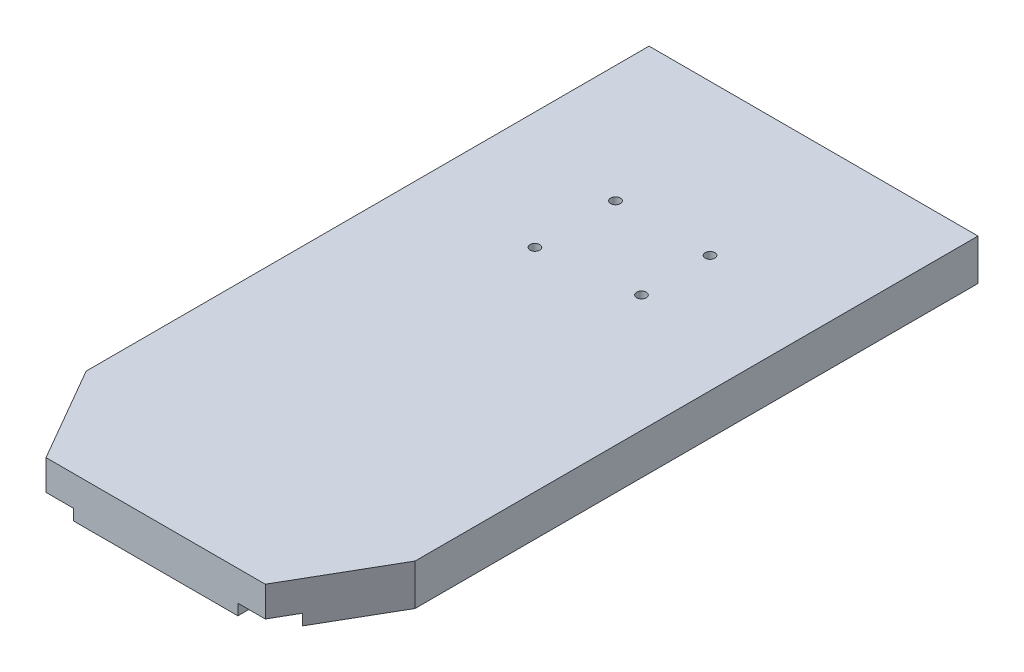
ISO-10303-21;
HEADER;
FILE_DESCRIPTION(('STEP AP214'),'2;1');
FILE_NAME('part.step','',(''),(''),'','','');
FILE_SCHEMA(('AUTOMOTIVE_DESIGN { 1 0 10303 214 1 1 1 1 }'));
ENDSEC;
DATA;
#1=APPLICATION_CONTEXT('core data for automotive mechanical design processes');
#2=APPLICATION_PROTOCOL_DEFINITION('international standard','automotive_design',2000,#1);
#3=PRODUCT_CONTEXT('',#1,'mechanical');
#4=PRODUCT('Part','Part','',(#3));
#5=PRODUCT_RELATED_PRODUCT_CATEGORY('part','',(#4));
#6=PRODUCT_DEFINITION_FORMATION('','',#4);
#7=PRODUCT_DEFINITION_CONTEXT('part definition',#1,'design');
#8=PRODUCT_DEFINITION('design','',#6,#7);
#9=PRODUCT_DEFINITION_SHAPE('','',#8);
#10=(LENGTH_UNIT() NAMED_UNIT(*) SI_UNIT(.MILLI.,.METRE.));
#11=(NAMED_UNIT(*) PLANE_ANGLE_UNIT() SI_UNIT($,.RADIAN.));
#12=(NAMED_UNIT(*) SI_UNIT($,.STERADIAN.) SOLID_ANGLE_UNIT());
#13=UNCERTAINTY_MEASURE_WITH_UNIT(LENGTH_MEASURE(1.E-05),#10,'distance_accuracy_value','');
#14=(GEOMETRIC_REPRESENTATION_CONTEXT(3) GLOBAL_UNCERTAINTY_ASSIGNED_CONTEXT((#13)) GLOBAL_UNIT_ASSIGNED_CONTEXT((#10,
#11,#12)) REPRESENTATION_CONTEXT('',''));
#15=CARTESIAN_POINT('',(0.,0.,0.));
#16=DIRECTION('',(0.,0.,1.));
#17=DIRECTION('',(1.,0.,0.));
#18=AXIS2_PLACEMENT_3D('',#15,#16,#17);
#19=CARTESIAN_POINT('',(-76.2,19.05,152.4));
#20=DIRECTION('',(0.,0.,-1.));
#21=DIRECTION('',(-1.,0.,0.));
#22=AXIS2_PLACEMENT_3D('',#19,#20,#21);
#23=PLANE('',#22);
#24=DIRECTION('',(1.,0.,0.));
#25=VECTOR('',#24,1.);
#26=CARTESIAN_POINT('',(-76.2,0.,152.4));
#27=LINE('',#26,#25);
#28=CARTESIAN_POINT('',(-38.1,0.,152.4));
#29=VERTEX_POINT('',#28);
#30=CARTESIAN_POINT('',(38.1,0.,152.4));
#31=VERTEX_POINT('',#30);
#32=EDGE_CURVE('E240',#29,#31,#27,.T.);
#33=ORIENTED_EDGE('',*,*,#32,.T.);
#34=DIRECTION('',(0.,-1.,0.));
#35=VECTOR('',#34,1.);
#36=CARTESIAN_POINT('',(38.1,5.08,152.4));
#37=LINE('',#36,#35);
#38=CARTESIAN_POINT('',(38.1,5.08,152.4));
#39=VERTEX_POINT('',#38);
#40=EDGE_CURVE('E150',#39,#31,#37,.T.);
#41=ORIENTED_EDGE('',*,*,#40,.F.);
#42=DIRECTION('',(-1.,0.,0.));
#43=VECTOR('',#42,1.);
#44=CARTESIAN_POINT('',(57.15,5.08,152.4));
#45=LINE('',#44,#43);
#46=CARTESIAN_POINT('',(50.8,5.08,152.4));
#47=VERTEX_POINT('',#46);
#48=EDGE_CURVE('E156',#47,#39,#45,.T.);
#49=ORIENTED_EDGE('',*,*,#48,.F.);
#50=DIRECTION('',(0.,-1.,0.));
#51=VECTOR('',#50,1.);
#52=CARTESIAN_POINT('',(50.8,19.05,152.4));
#53=LINE('',#52,#51);
#54=CARTESIAN_POINT('',(50.8,19.05,152.4));
#55=VERTEX_POINT('',#54);
#56=EDGE_CURVE('E195',#55,#47,#53,.T.);
#57=ORIENTED_EDGE('',*,*,#56,.F.);
#58=DIRECTION('',(1.,0.,0.));
#59=VECTOR('',#58,1.);
#60=CARTESIAN_POINT('',(-76.2,19.05,152.4));
#61=LINE('',#60,#59);
#62=CARTESIAN_POINT('',(-50.8,19.05,152.4));
#63=VERTEX_POINT('',#62);
#64=EDGE_CURVE('E245',#63,#55,#61,.T.);
#65=ORIENTED_EDGE('',*,*,#64,.F.);
#66=DIRECTION('',(0.,-1.,0.));
#67=VECTOR('',#66,1.);
#68=CARTESIAN_POINT('',(-50.8,19.05,152.4));
#69=LINE('',#68,#67);
#70=CARTESIAN_POINT('',(-50.8,5.08,152.4));
#71=VERTEX_POINT('',#70);
#72=EDGE_CURVE('E207',#63,#71,#69,.T.);
#73=ORIENTED_EDGE('',*,*,#72,.T.);
#74=DIRECTION('',(1.,0.,0.));
#75=VECTOR('',#74,1.);
#76=CARTESIAN_POINT('',(-57.15,5.08,152.4));
#77=LINE('',#76,#75);
#78=CARTESIAN_POINT('',(-38.1,5.08,152.4));
#79=VERTEX_POINT('',#78);
#80=EDGE_CURVE('E52',#71,#79,#77,.T.);
#81=ORIENTED_EDGE('',*,*,#80,.T.);
#82=DIRECTION('',(0.,-1.,0.));
#83=VECTOR('',#82,1.);
#84=CARTESIAN_POINT('',(-38.1,5.08,152.4));
#85=LINE('',#84,#83);
#86=EDGE_CURVE('E175',#79,#29,#85,.T.);
#87=ORIENTED_EDGE('',*,*,#86,.T.);
#88=EDGE_LOOP('',(#33,#41,#49,#57,#65,#73,#81,#87));
#89=FACE_BOUND('',#88,.T.);
#90=ADVANCED_FACE('F37',(#89),#23,.F.);
#91=CARTESIAN_POINT('',(0.,0.,0.));
#92=DIRECTION('',(0.,-1.,0.));
#93=DIRECTION('',(0.,0.,-1.));
#94=AXIS2_PLACEMENT_3D('',#91,#92,#93);
#95=PLANE('',#94);
#96=DIRECTION('',(0.499999999999994,0.,-0.866025403784442));
#97=VECTOR('',#96,1.);
#98=CARTESIAN_POINT('',(104.091135768374,0.,60.0970452561237));
#99=LINE('',#98,#97);
#100=CARTESIAN_POINT('',(57.15,0.,141.401477371938));
#101=VERTEX_POINT('',#100);
#102=CARTESIAN_POINT('',(76.2,0.,108.40590948775));
#103=VERTEX_POINT('',#102);
#104=EDGE_CURVE('E196',#101,#103,#99,.T.);
#105=ORIENTED_EDGE('',*,*,#104,.F.);
#106=DIRECTION('',(0.,0.,-1.));
#107=VECTOR('',#106,1.);
#108=CARTESIAN_POINT('',(57.15,0.,152.4));
#109=LINE('',#108,#107);
#110=CARTESIAN_POINT('',(57.15,0.,-152.4));
#111=VERTEX_POINT('',#110);
#112=EDGE_CURVE('E161',#101,#111,#109,.T.);
#113=ORIENTED_EDGE('',*,*,#112,.T.);
#114=DIRECTION('',(-1.,0.,0.));
#115=VECTOR('',#114,1.);
#116=CARTESIAN_POINT('',(-76.2,0.,-152.4));
#117=LINE('',#116,#115);
#118=CARTESIAN_POINT('',(76.2,0.,-152.4));
#119=VERTEX_POINT('',#118);
#120=EDGE_CURVE('E251',#119,#111,#117,.T.);
#121=ORIENTED_EDGE('',*,*,#120,.F.);
#122=DIRECTION('',(0.,0.,-1.));
#123=VECTOR('',#122,1.);
#124=CARTESIAN_POINT('',(76.2,0.,152.4));
#125=LINE('',#124,#123);
#126=EDGE_CURVE('E236',#103,#119,#125,.T.);
#127=ORIENTED_EDGE('',*,*,#126,.F.);
#128=EDGE_LOOP('',(#105,#113,#121,#127));
#129=FACE_BOUND('',#128,.T.);
#130=ADVANCED_FACE('F304',(#129),#95,.T.);
#131=DIRECTION('',(0.,0.,-1.));
#132=VECTOR('',#131,1.);
#133=CARTESIAN_POINT('',(38.1,0.,152.4));
#134=LINE('',#133,#132);
#135=CARTESIAN_POINT('',(38.1,0.,-152.4));
#136=VERTEX_POINT('',#135);
#137=EDGE_CURVE('E144',#31,#136,#134,.T.);
#138=ORIENTED_EDGE('',*,*,#137,.F.);
#139=ORIENTED_EDGE('',*,*,#32,.F.);
#140=DIRECTION('',(0.,0.,-1.));
#141=VECTOR('',#140,1.);
#142=CARTESIAN_POINT('',(-38.1,0.,152.4));
#143=LINE('',#142,#141);
#144=CARTESIAN_POINT('',(-38.1,0.,-152.4));
#145=VERTEX_POINT('',#144);
#146=EDGE_CURVE('E168',#29,#145,#143,.T.);
#147=ORIENTED_EDGE('',*,*,#146,.T.);
#148=EDGE_CURVE('E254',#136,#145,#117,.T.);
#149=ORIENTED_EDGE('',*,*,#148,.F.);
#150=EDGE_LOOP('',(#138,#139,#147,#149));
#151=FACE_BOUND('',#150,.T.);
#152=CARTESIAN_POINT('',(-21.8900000000001,0.,-82.55));
#153=DIRECTION('',(0.,1.,0.));
#154=DIRECTION('',(0.,0.,1.));
#155=AXIS2_PLACEMENT_3D('',#152,#153,#154);
#156=CIRCLE('',#155,2.2479);
#157=CARTESIAN_POINT('',(-21.8900000000001,0.,-80.3021));
#158=VERTEX_POINT('',#157);
#159=EDGE_CURVE('E215',#158,#158,#156,.T.);
#160=ORIENTED_EDGE('',*,*,#159,.T.);
#161=EDGE_LOOP('',(#160));
#162=FACE_BOUND('',#161,.T.);
#163=CARTESIAN_POINT('',(21.8899999999999,0.,-82.55));
#164=DIRECTION('',(0.,1.,0.));
#165=DIRECTION('',(0.,0.,1.));
#166=AXIS2_PLACEMENT_3D('',#163,#164,#165);
#167=CIRCLE('',#166,2.2479);
#168=CARTESIAN_POINT('',(21.8899999999999,0.,-80.3021));
#169=VERTEX_POINT('',#168);
#170=EDGE_CURVE('E221',#169,#169,#167,.T.);
#171=ORIENTED_EDGE('',*,*,#170,.T.);
#172=EDGE_LOOP('',(#171));
#173=FACE_BOUND('',#172,.T.);
#174=CARTESIAN_POINT('',(-21.8900000000001,0.,-45.212));
#175=DIRECTION('',(0.,1.,0.));
#176=DIRECTION('',(0.,0.,1.));
#177=AXIS2_PLACEMENT_3D('',#174,#175,#176);
#178=CIRCLE('',#177,2.2479);
#179=CARTESIAN_POINT('',(-21.8900000000001,0.,-42.9641));
#180=VERTEX_POINT('',#179);
#181=EDGE_CURVE('E227',#180,#180,#178,.T.);
#182=ORIENTED_EDGE('',*,*,#181,.T.);
#183=EDGE_LOOP('',(#182));
#184=FACE_BOUND('',#183,.T.);
#185=CARTESIAN_POINT('',(21.8899999999999,0.,-50.8));
#186=DIRECTION('',(0.,1.,0.));
#187=DIRECTION('',(0.,0.,1.));
#188=AXIS2_PLACEMENT_3D('',#185,#186,#187);
#189=CIRCLE('',#188,2.2479);
#190=CARTESIAN_POINT('',(21.8899999999999,0.,-48.5521));
#191=VERTEX_POINT('',#190);
#192=EDGE_CURVE('E233',#191,#191,#189,.T.);
#193=ORIENTED_EDGE('',*,*,#192,.T.);
#194=EDGE_LOOP('',(#193));
#195=FACE_BOUND('',#194,.T.);
#196=ADVANCED_FACE('F312',(#151,#162,#173,#184,#195),#95,.T.);
#197=CARTESIAN_POINT('',(104.091135768374,19.05,60.0970452561237));
#198=DIRECTION('',(-0.866025403784442,0.,-0.499999999999994));
#199=DIRECTION('',(-0.499999999999994,0.,0.866025403784442));
#200=AXIS2_PLACEMENT_3D('',#197,#198,#199);
#201=PLANE('',#200);
#202=DIRECTION('',(0.,1.,0.));
#203=VECTOR('',#202,1.);
#204=CARTESIAN_POINT('',(57.15,19.05,141.401477371937));
#205=LINE('',#204,#203);
#206=CARTESIAN_POINT('',(57.15,5.08,141.401477371937));
#207=VERTEX_POINT('',#206);
#208=EDGE_CURVE('E266',#101,#207,#205,.T.);
#209=ORIENTED_EDGE('',*,*,#208,.F.);
#210=ORIENTED_EDGE('',*,*,#104,.T.);
#211=DIRECTION('',(0.,-1.,0.));
#212=VECTOR('',#211,1.);
#213=CARTESIAN_POINT('',(76.2,19.05,108.40590948775));
#214=LINE('',#213,#212);
#215=CARTESIAN_POINT('',(76.2,19.05,108.40590948775));
#216=VERTEX_POINT('',#215);
#217=EDGE_CURVE('E199',#216,#103,#214,.T.);
#218=ORIENTED_EDGE('',*,*,#217,.F.);
#219=DIRECTION('',(0.499999999999994,0.,-0.866025403784442));
#220=VECTOR('',#219,1.);
#221=CARTESIAN_POINT('',(104.091135768374,19.05,60.0970452561237));
#222=LINE('',#221,#220);
#223=EDGE_CURVE('E192',#55,#216,#222,.T.);
#224=ORIENTED_EDGE('',*,*,#223,.F.);
#225=ORIENTED_EDGE('',*,*,#56,.T.);
#226=DIRECTION('',(-0.499999999999994,0.,0.866025403784442));
#227=VECTOR('',#226,1.);
#228=CARTESIAN_POINT('',(104.091135768374,5.08,60.0970452561237));
#229=LINE('',#228,#227);
#230=EDGE_CURVE('E264',#207,#47,#229,.T.);
#231=ORIENTED_EDGE('',*,*,#230,.F.);
#232=EDGE_LOOP('',(#209,#210,#218,#224,#225,#231));
#233=FACE_BOUND('',#232,.T.);
#234=ADVANCED_FACE('F310',(#233),#201,.F.);
#235=CARTESIAN_POINT('',(-76.2,19.05,152.4));
#236=DIRECTION('',(1.,0.,0.));
#237=DIRECTION('',(0.,0.,-1.));
#238=AXIS2_PLACEMENT_3D('',#235,#236,#237);
#239=PLANE('',#238);
#240=DIRECTION('',(0.,-1.,0.));
#241=VECTOR('',#240,1.);
#242=CARTESIAN_POINT('',(-76.2,19.05,108.40590948775));
#243=LINE('',#242,#241);
#244=CARTESIAN_POINT('',(-76.2,19.05,108.40590948775));
#245=VERTEX_POINT('',#244);
#246=CARTESIAN_POINT('',(-76.2,0.,108.40590948775));
#247=VERTEX_POINT('',#246);
#248=EDGE_CURVE('E198',#245,#247,#243,.T.);
#249=ORIENTED_EDGE('',*,*,#248,.F.);
#250=DIRECTION('',(0.,0.,1.));
#251=VECTOR('',#250,1.);
#252=CARTESIAN_POINT('',(-76.2,19.05,152.4));
#253=LINE('',#252,#251);
#254=CARTESIAN_POINT('',(-76.2,19.05,-152.4));
#255=VERTEX_POINT('',#254);
#256=EDGE_CURVE('E242',#255,#245,#253,.T.);
#257=ORIENTED_EDGE('',*,*,#256,.F.);
#258=DIRECTION('',(0.,-1.,0.));
#259=VECTOR('',#258,1.);
#260=CARTESIAN_POINT('',(-76.2,19.05,-152.4));
#261=LINE('',#260,#259);
#262=CARTESIAN_POINT('',(-76.2,0.,-152.4));
#263=VERTEX_POINT('',#262);
#264=EDGE_CURVE('E248',#255,#263,#261,.T.);
#265=ORIENTED_EDGE('',*,*,#264,.T.);
#266=DIRECTION('',(0.,0.,1.));
#267=VECTOR('',#266,1.);
#268=CARTESIAN_POINT('',(-76.2,0.,152.4));
#269=LINE('',#268,#267);
#270=EDGE_CURVE('E253',#263,#247,#269,.T.);
#271=ORIENTED_EDGE('',*,*,#270,.T.);
#272=EDGE_LOOP('',(#249,#257,#265,#271));
#273=FACE_BOUND('',#272,.T.);
#274=ADVANCED_FACE('F296',(#273),#239,.F.);
#275=CARTESIAN_POINT('',(0.,19.05,0.));
#276=DIRECTION('',(0.,-1.,0.));
#277=DIRECTION('',(0.,0.,-1.));
#278=AXIS2_PLACEMENT_3D('',#275,#276,#277);
#279=PLANE('',#278);
#280=CARTESIAN_POINT('',(21.8899999999999,19.05,-50.8));
#281=DIRECTION('',(0.,1.,0.));
#282=DIRECTION('',(0.,0.,1.));
#283=AXIS2_PLACEMENT_3D('',#280,#281,#282);
#284=CIRCLE('',#283,2.24789999999999);
#285=CARTESIAN_POINT('',(21.8899999999999,19.05,-48.5521));
#286=VERTEX_POINT('',#285);
#287=EDGE_CURVE('E230',#286,#286,#284,.T.);
#288=ORIENTED_EDGE('',*,*,#287,.F.);
#289=EDGE_LOOP('',(#288));
#290=FACE_BOUND('',#289,.T.);
#291=CARTESIAN_POINT('',(-21.8900000000001,19.05,-45.212));
#292=DIRECTION('',(0.,1.,0.));
#293=DIRECTION('',(0.,0.,1.));
#294=AXIS2_PLACEMENT_3D('',#291,#292,#293);
#295=CIRCLE('',#294,2.24789999999999);
#296=CARTESIAN_POINT('',(-21.8900000000001,19.05,-42.9641));
#297=VERTEX_POINT('',#296);
#298=EDGE_CURVE('E224',#297,#297,#295,.T.);
#299=ORIENTED_EDGE('',*,*,#298,.F.);
#300=EDGE_LOOP('',(#299));
#301=FACE_BOUND('',#300,.T.);
#302=CARTESIAN_POINT('',(21.8899999999999,19.05,-82.55));
#303=DIRECTION('',(0.,1.,0.));
#304=DIRECTION('',(0.,0.,1.));
#305=AXIS2_PLACEMENT_3D('',#302,#303,#304);
#306=CIRCLE('',#305,2.24789999999999);
#307=CARTESIAN_POINT('',(21.8899999999999,19.05,-80.3021));
#308=VERTEX_POINT('',#307);
#309=EDGE_CURVE('E218',#308,#308,#306,.T.);
#310=ORIENTED_EDGE('',*,*,#309,.F.);
#311=EDGE_LOOP('',(#310));
#312=FACE_BOUND('',#311,.T.);
#313=CARTESIAN_POINT('',(-21.8900000000001,19.05,-82.55));
#314=DIRECTION('',(0.,1.,0.));
#315=DIRECTION('',(0.,0.,1.));
#316=AXIS2_PLACEMENT_3D('',#313,#314,#315);
#317=CIRCLE('',#316,2.24789999999999);
#318=CARTESIAN_POINT('',(-21.8900000000001,19.05,-80.3021));
#319=VERTEX_POINT('',#318);
#320=EDGE_CURVE('E202',#319,#319,#317,.T.);
#321=ORIENTED_EDGE('',*,*,#320,.F.);
#322=EDGE_LOOP('',(#321));
#323=FACE_BOUND('',#322,.T.);
#324=ORIENTED_EDGE('',*,*,#64,.T.);
#325=ORIENTED_EDGE('',*,*,#223,.T.);
#326=DIRECTION('',(0.,0.,-1.));
#327=VECTOR('',#326,1.);
#328=CARTESIAN_POINT('',(76.2,19.05,152.4));
#329=LINE('',#328,#327);
#330=CARTESIAN_POINT('',(76.2,19.05,-152.4));
#331=VERTEX_POINT('',#330);
#332=EDGE_CURVE('E237',#216,#331,#329,.T.);
#333=ORIENTED_EDGE('',*,*,#332,.T.);
#334=DIRECTION('',(-1.,0.,0.));
#335=VECTOR('',#334,1.);
#336=CARTESIAN_POINT('',(-76.2,19.05,-152.4));
#337=LINE('',#336,#335);
#338=EDGE_CURVE('E239',#331,#255,#337,.T.);
#339=ORIENTED_EDGE('',*,*,#338,.T.);
#340=ORIENTED_EDGE('',*,*,#256,.T.);
#341=DIRECTION('',(-0.499999999999995,0.,-0.866025403784442));
#342=VECTOR('',#341,1.);
#343=CARTESIAN_POINT('',(-104.091135768374,19.05,60.0970452561238));
#344=LINE('',#343,#342);
#345=EDGE_CURVE('E205',#63,#245,#344,.T.);
#346=ORIENTED_EDGE('',*,*,#345,.F.);
#347=EDGE_LOOP('',(#324,#325,#333,#339,#340,#346));
#348=FACE_BOUND('',#347,.T.);
#349=ADVANCED_FACE('F292',(#290,#301,#312,#323,#348),#279,.F.);
#350=DIRECTION('',(0.,0.,-1.));
#351=VECTOR('',#350,1.);
#352=CARTESIAN_POINT('',(-57.15,0.,152.4));
#353=LINE('',#352,#351);
#354=CARTESIAN_POINT('',(-57.15,0.,141.401477371937));
#355=VERTEX_POINT('',#354);
#356=CARTESIAN_POINT('',(-57.15,0.,-152.4));
#357=VERTEX_POINT('',#356);
#358=EDGE_CURVE('E181',#355,#357,#353,.T.);
#359=ORIENTED_EDGE('',*,*,#358,.F.);
#360=DIRECTION('',(-0.499999999999995,0.,-0.866025403784442));
#361=VECTOR('',#360,1.);
#362=CARTESIAN_POINT('',(-104.091135768374,0.,60.0970452561238));
#363=LINE('',#362,#361);
#364=EDGE_CURVE('E149',#355,#247,#363,.T.);
#365=ORIENTED_EDGE('',*,*,#364,.T.);
#366=ORIENTED_EDGE('',*,*,#270,.F.);
#367=EDGE_CURVE('E250',#357,#263,#117,.T.);
#368=ORIENTED_EDGE('',*,*,#367,.F.);
#369=EDGE_LOOP('',(#359,#365,#366,#368));
#370=FACE_BOUND('',#369,.T.);
#371=ADVANCED_FACE('F281',(#370),#95,.T.);
#372=CARTESIAN_POINT('',(76.2,19.05,152.4));
#373=DIRECTION('',(-1.,0.,0.));
#374=DIRECTION('',(0.,0.,1.));
#375=AXIS2_PLACEMENT_3D('',#372,#373,#374);
#376=PLANE('',#375);
#377=ORIENTED_EDGE('',*,*,#332,.F.);
#378=ORIENTED_EDGE('',*,*,#217,.T.);
#379=ORIENTED_EDGE('',*,*,#126,.T.);
#380=DIRECTION('',(0.,-1.,0.));
#381=VECTOR('',#380,1.);
#382=CARTESIAN_POINT('',(76.2,19.05,-152.4));
#383=LINE('',#382,#381);
#384=EDGE_CURVE('E261',#331,#119,#383,.T.);
#385=ORIENTED_EDGE('',*,*,#384,.F.);
#386=EDGE_LOOP('',(#377,#378,#379,#385));
#387=FACE_BOUND('',#386,.T.);
#388=ADVANCED_FACE('F39',(#387),#376,.F.);
#389=CARTESIAN_POINT('',(-76.2,19.05,-152.4));
#390=DIRECTION('',(0.,0.,1.));
#391=DIRECTION('',(1.,0.,0.));
#392=AXIS2_PLACEMENT_3D('',#389,#390,#391);
#393=PLANE('',#392);
#394=DIRECTION('',(-1.,0.,0.));
#395=VECTOR('',#394,1.);
#396=CARTESIAN_POINT('',(57.15,5.08,-152.4));
#397=LINE('',#396,#395);
#398=CARTESIAN_POINT('',(57.15,5.08,-152.4));
#399=VERTEX_POINT('',#398);
#400=CARTESIAN_POINT('',(38.1,5.08,-152.4));
#401=VERTEX_POINT('',#400);
#402=EDGE_CURVE('E153',#399,#401,#397,.T.);
#403=ORIENTED_EDGE('',*,*,#402,.T.);
#404=DIRECTION('',(0.,-1.,0.));
#405=VECTOR('',#404,1.);
#406=CARTESIAN_POINT('',(38.1,5.08,-152.4));
#407=LINE('',#406,#405);
#408=EDGE_CURVE('E138',#401,#136,#407,.T.);
#409=ORIENTED_EDGE('',*,*,#408,.T.);
#410=ORIENTED_EDGE('',*,*,#148,.T.);
#411=DIRECTION('',(0.,-1.,0.));
#412=VECTOR('',#411,1.);
#413=CARTESIAN_POINT('',(-38.1,5.08,-152.4));
#414=LINE('',#413,#412);
#415=CARTESIAN_POINT('',(-38.1,5.08,-152.4));
#416=VERTEX_POINT('',#415);
#417=EDGE_CURVE('E172',#416,#145,#414,.T.);
#418=ORIENTED_EDGE('',*,*,#417,.F.);
#419=DIRECTION('',(1.,0.,0.));
#420=VECTOR('',#419,1.);
#421=CARTESIAN_POINT('',(-57.15,5.08,-152.4));
#422=LINE('',#421,#420);
#423=CARTESIAN_POINT('',(-57.15,5.08,-152.4));
#424=VERTEX_POINT('',#423);
#425=EDGE_CURVE('E183',#424,#416,#422,.T.);
#426=ORIENTED_EDGE('',*,*,#425,.F.);
#427=DIRECTION('',(0.,-1.,0.));
#428=VECTOR('',#427,1.);
#429=CARTESIAN_POINT('',(-57.15,5.08,-152.4));
#430=LINE('',#429,#428);
#431=EDGE_CURVE('E178',#424,#357,#430,.T.);
#432=ORIENTED_EDGE('',*,*,#431,.T.);
#433=ORIENTED_EDGE('',*,*,#367,.T.);
#434=ORIENTED_EDGE('',*,*,#264,.F.);
#435=ORIENTED_EDGE('',*,*,#338,.F.);
#436=ORIENTED_EDGE('',*,*,#384,.T.);
#437=ORIENTED_EDGE('',*,*,#120,.T.);
#438=DIRECTION('',(0.,-1.,0.));
#439=VECTOR('',#438,1.);
#440=CARTESIAN_POINT('',(57.15,5.08,-152.4));
#441=LINE('',#440,#439);
#442=EDGE_CURVE('E160',#399,#111,#441,.T.);
#443=ORIENTED_EDGE('',*,*,#442,.F.);
#444=EDGE_LOOP('',(#403,#409,#410,#418,#426,#432,#433,#434,#435,#436,#437,#443));
#445=FACE_BOUND('',#444,.T.);
#446=ADVANCED_FACE('F158',(#445),#393,.F.);
#447=CARTESIAN_POINT('',(21.8899999999999,19.05,-50.8));
#448=DIRECTION('',(0.,1.,0.));
#449=DIRECTION('',(0.,0.,1.));
#450=AXIS2_PLACEMENT_3D('',#447,#448,#449);
#451=CYLINDRICAL_SURFACE('',#450,2.24789999999999);
#452=ORIENTED_EDGE('',*,*,#192,.F.);
#453=EDGE_LOOP('',(#452));
#454=FACE_BOUND('',#453,.T.);
#455=ORIENTED_EDGE('',*,*,#287,.T.);
#456=EDGE_LOOP('',(#455));
#457=FACE_BOUND('',#456,.T.);
#458=ADVANCED_FACE('F335',(#454,#457),#451,.F.);
#459=CARTESIAN_POINT('',(-21.8900000000001,19.05,-45.212));
#460=DIRECTION('',(0.,1.,0.));
#461=DIRECTION('',(0.,0.,1.));
#462=AXIS2_PLACEMENT_3D('',#459,#460,#461);
#463=CYLINDRICAL_SURFACE('',#462,2.24789999999999);
#464=ORIENTED_EDGE('',*,*,#181,.F.);
#465=EDGE_LOOP('',(#464));
#466=FACE_BOUND('',#465,.T.);
#467=ORIENTED_EDGE('',*,*,#298,.T.);
#468=EDGE_LOOP('',(#467));
#469=FACE_BOUND('',#468,.T.);
#470=ADVANCED_FACE('F341',(#466,#469),#463,.F.);
#471=CARTESIAN_POINT('',(21.8899999999999,19.05,-82.55));
#472=DIRECTION('',(0.,1.,0.));
#473=DIRECTION('',(0.,0.,1.));
#474=AXIS2_PLACEMENT_3D('',#471,#472,#473);
#475=CYLINDRICAL_SURFACE('',#474,2.24789999999999);
#476=ORIENTED_EDGE('',*,*,#170,.F.);
#477=EDGE_LOOP('',(#476));
#478=FACE_BOUND('',#477,.T.);
#479=ORIENTED_EDGE('',*,*,#309,.T.);
#480=EDGE_LOOP('',(#479));
#481=FACE_BOUND('',#480,.T.);
#482=ADVANCED_FACE('F363',(#478,#481),#475,.F.);
#483=CARTESIAN_POINT('',(-21.8900000000001,19.05,-82.55));
#484=DIRECTION('',(0.,1.,0.));
#485=DIRECTION('',(0.,0.,1.));
#486=AXIS2_PLACEMENT_3D('',#483,#484,#485);
#487=CYLINDRICAL_SURFACE('',#486,2.24789999999999);
#488=ORIENTED_EDGE('',*,*,#159,.F.);
#489=EDGE_LOOP('',(#488));
#490=FACE_BOUND('',#489,.T.);
#491=ORIENTED_EDGE('',*,*,#320,.T.);
#492=EDGE_LOOP('',(#491));
#493=FACE_BOUND('',#492,.T.);
#494=ADVANCED_FACE('F360',(#490,#493),#487,.F.);
#495=CARTESIAN_POINT('',(-104.091135768374,19.05,60.0970452561238));
#496=DIRECTION('',(-0.866025403784442,0.,0.499999999999995));
#497=DIRECTION('',(0.499999999999995,0.,0.866025403784442));
#498=AXIS2_PLACEMENT_3D('',#495,#496,#497);
#499=PLANE('',#498);
#500=DIRECTION('',(0.,-1.,0.));
#501=VECTOR('',#500,1.);
#502=CARTESIAN_POINT('',(-57.15,19.05,141.401477371937));
#503=LINE('',#502,#501);
#504=CARTESIAN_POINT('',(-57.15,5.08,141.401477371937));
#505=VERTEX_POINT('',#504);
#506=EDGE_CURVE('E11',#505,#355,#503,.T.);
#507=ORIENTED_EDGE('',*,*,#506,.F.);
#508=DIRECTION('',(-0.499999999999995,0.,-0.866025403784442));
#509=VECTOR('',#508,1.);
#510=CARTESIAN_POINT('',(-104.091135768374,5.08,60.0970452561238));
#511=LINE('',#510,#509);
#512=EDGE_CURVE('E45',#71,#505,#511,.T.);
#513=ORIENTED_EDGE('',*,*,#512,.F.);
#514=ORIENTED_EDGE('',*,*,#72,.F.);
#515=ORIENTED_EDGE('',*,*,#345,.T.);
#516=ORIENTED_EDGE('',*,*,#248,.T.);
#517=ORIENTED_EDGE('',*,*,#364,.F.);
#518=EDGE_LOOP('',(#507,#513,#514,#515,#516,#517));
#519=FACE_BOUND('',#518,.T.);
#520=ADVANCED_FACE('F277',(#519),#499,.T.);
#521=CARTESIAN_POINT('',(57.15,5.08,152.4));
#522=DIRECTION('',(-1.,0.,0.));
#523=DIRECTION('',(0.,0.,1.));
#524=AXIS2_PLACEMENT_3D('',#521,#522,#523);
#525=PLANE('',#524);
#526=ORIENTED_EDGE('',*,*,#208,.T.);
#527=DIRECTION('',(0.,0.,-1.));
#528=VECTOR('',#527,1.);
#529=CARTESIAN_POINT('',(57.15,5.08,152.4));
#530=LINE('',#529,#528);
#531=EDGE_CURVE('E60',#207,#399,#530,.T.);
#532=ORIENTED_EDGE('',*,*,#531,.T.);
#533=ORIENTED_EDGE('',*,*,#442,.T.);
#534=ORIENTED_EDGE('',*,*,#112,.F.);
#535=EDGE_LOOP('',(#526,#532,#533,#534));
#536=FACE_BOUND('',#535,.T.);
#537=ADVANCED_FACE('F307',(#536),#525,.T.);
#538=CARTESIAN_POINT('',(0.,5.08,0.));
#539=DIRECTION('',(0.,-1.,0.));
#540=DIRECTION('',(0.,0.,-1.));
#541=AXIS2_PLACEMENT_3D('',#538,#539,#540);
#542=PLANE('',#541);
#543=ORIENTED_EDGE('',*,*,#230,.T.);
#544=ORIENTED_EDGE('',*,*,#48,.T.);
#545=DIRECTION('',(0.,0.,-1.));
#546=VECTOR('',#545,1.);
#547=CARTESIAN_POINT('',(38.1,5.08,152.4));
#548=LINE('',#547,#546);
#549=EDGE_CURVE('E141',#39,#401,#548,.T.);
#550=ORIENTED_EDGE('',*,*,#549,.T.);
#551=ORIENTED_EDGE('',*,*,#402,.F.);
#552=ORIENTED_EDGE('',*,*,#531,.F.);
#553=EDGE_LOOP('',(#543,#544,#550,#551,#552));
#554=FACE_BOUND('',#553,.T.);
#555=ADVANCED_FACE('F152',(#554),#542,.T.);
#556=CARTESIAN_POINT('',(38.1,5.08,152.4));
#557=DIRECTION('',(-1.,0.,0.));
#558=DIRECTION('',(0.,0.,1.));
#559=AXIS2_PLACEMENT_3D('',#556,#557,#558);
#560=PLANE('',#559);
#561=ORIENTED_EDGE('',*,*,#137,.T.);
#562=ORIENTED_EDGE('',*,*,#408,.F.);
#563=ORIENTED_EDGE('',*,*,#549,.F.);
#564=ORIENTED_EDGE('',*,*,#40,.T.);
#565=EDGE_LOOP('',(#561,#562,#563,#564));
#566=FACE_BOUND('',#565,.T.);
#567=ADVANCED_FACE('F140',(#566),#560,.F.);
#568=CARTESIAN_POINT('',(-57.15,5.08,152.4));
#569=DIRECTION('',(-1.,0.,0.));
#570=DIRECTION('',(0.,0.,1.));
#571=AXIS2_PLACEMENT_3D('',#568,#569,#570);
#572=PLANE('',#571);
#573=ORIENTED_EDGE('',*,*,#506,.T.);
#574=ORIENTED_EDGE('',*,*,#358,.T.);
#575=ORIENTED_EDGE('',*,*,#431,.F.);
#576=DIRECTION('',(0.,0.,-1.));
#577=VECTOR('',#576,1.);
#578=CARTESIAN_POINT('',(-57.15,5.08,152.4));
#579=LINE('',#578,#577);
#580=EDGE_CURVE('E174',#505,#424,#579,.T.);
#581=ORIENTED_EDGE('',*,*,#580,.F.);
#582=EDGE_LOOP('',(#573,#574,#575,#581));
#583=FACE_BOUND('',#582,.T.);
#584=ADVANCED_FACE('F273',(#583),#572,.F.);
#585=CARTESIAN_POINT('',(-38.1,5.08,152.4));
#586=DIRECTION('',(-1.,0.,0.));
#587=DIRECTION('',(0.,0.,1.));
#588=AXIS2_PLACEMENT_3D('',#585,#586,#587);
#589=PLANE('',#588);
#590=ORIENTED_EDGE('',*,*,#146,.F.);
#591=ORIENTED_EDGE('',*,*,#86,.F.);
#592=DIRECTION('',(0.,0.,-1.));
#593=VECTOR('',#592,1.);
#594=CARTESIAN_POINT('',(-38.1,5.08,152.4));
#595=LINE('',#594,#593);
#596=EDGE_CURVE('E188',#79,#416,#595,.T.);
#597=ORIENTED_EDGE('',*,*,#596,.T.);
#598=ORIENTED_EDGE('',*,*,#417,.T.);
#599=EDGE_LOOP('',(#590,#591,#597,#598));
#600=FACE_BOUND('',#599,.T.);
#601=ADVANCED_FACE('F314',(#600),#589,.T.);
#602=CARTESIAN_POINT('',(0.,5.08,0.));
#603=DIRECTION('',(0.,1.,0.));
#604=DIRECTION('',(0.,0.,1.));
#605=AXIS2_PLACEMENT_3D('',#602,#603,#604);
#606=PLANE('',#605);
#607=ORIENTED_EDGE('',*,*,#512,.T.);
#608=ORIENTED_EDGE('',*,*,#580,.T.);
#609=ORIENTED_EDGE('',*,*,#425,.T.);
#610=ORIENTED_EDGE('',*,*,#596,.F.);
#611=ORIENTED_EDGE('',*,*,#80,.F.);
#612=EDGE_LOOP('',(#607,#608,#609,#610,#611));
#613=FACE_BOUND('',#612,.T.);
#614=ADVANCED_FACE('F268',(#613),#606,.F.);
#615=CLOSED_SHELL('',(#90,#130,#196,#234,#274,#349,#371,#388,#446,#458,#470,#482,#494,#520,#537,
#555,#567,#584,#601,#614));
#616=MANIFOLD_SOLID_BREP('B2',#615);
#617=ADVANCED_BREP_SHAPE_REPRESENTATION('',(#18,#616),#14);
#618=SHAPE_DEFINITION_REPRESENTATION(#9,#617);
ENDSEC;
END-ISO-10303-21;
